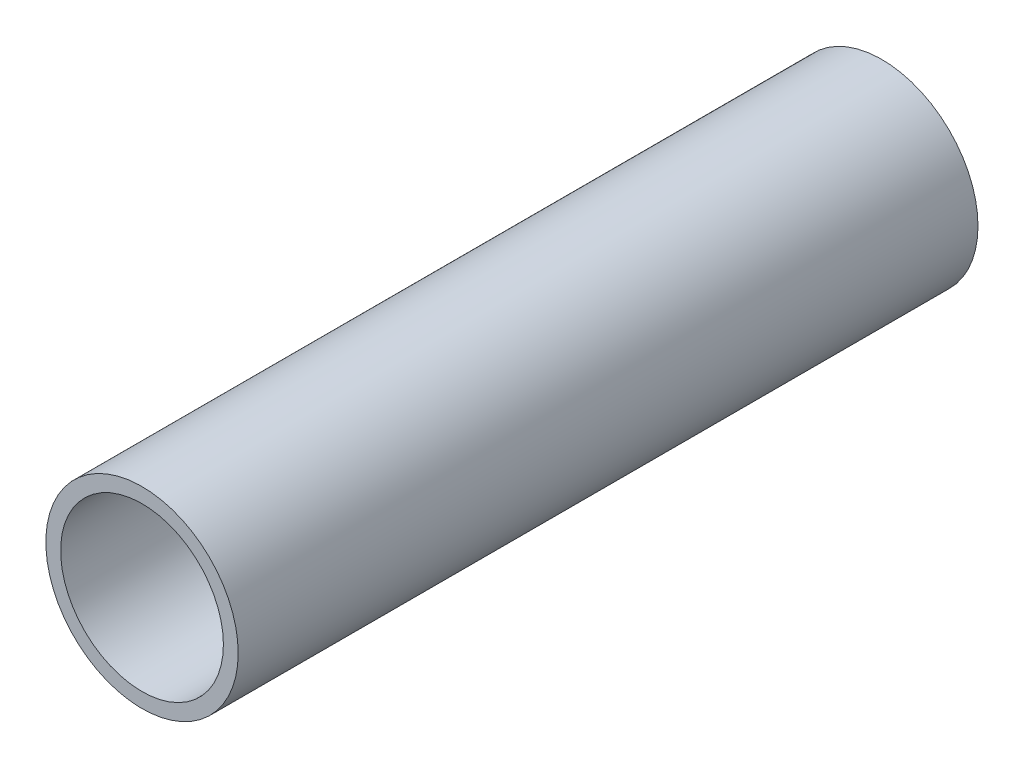
ISO-10303-21;
HEADER;
FILE_DESCRIPTION(('STEP AP214'),'2;1');
FILE_NAME('part.step','',(''),(''),'','','');
FILE_SCHEMA(('AUTOMOTIVE_DESIGN { 1 0 10303 214 1 1 1 1 }'));
ENDSEC;
DATA;
#1=APPLICATION_CONTEXT('core data for automotive mechanical design processes');
#2=APPLICATION_PROTOCOL_DEFINITION('international standard','automotive_design',2000,#1);
#3=PRODUCT_CONTEXT('',#1,'mechanical');
#4=PRODUCT('Part','Part','',(#3));
#5=PRODUCT_RELATED_PRODUCT_CATEGORY('part','',(#4));
#6=PRODUCT_DEFINITION_FORMATION('','',#4);
#7=PRODUCT_DEFINITION_CONTEXT('part definition',#1,'design');
#8=PRODUCT_DEFINITION('design','',#6,#7);
#9=PRODUCT_DEFINITION_SHAPE('','',#8);
#10=(LENGTH_UNIT() NAMED_UNIT(*) SI_UNIT(.MILLI.,.METRE.));
#11=(NAMED_UNIT(*) PLANE_ANGLE_UNIT() SI_UNIT($,.RADIAN.));
#12=(NAMED_UNIT(*) SI_UNIT($,.STERADIAN.) SOLID_ANGLE_UNIT());
#13=UNCERTAINTY_MEASURE_WITH_UNIT(LENGTH_MEASURE(1.E-05),#10,'distance_accuracy_value','');
#14=(GEOMETRIC_REPRESENTATION_CONTEXT(3) GLOBAL_UNCERTAINTY_ASSIGNED_CONTEXT((#13)) GLOBAL_UNIT_ASSIGNED_CONTEXT((#10,
#11,#12)) REPRESENTATION_CONTEXT('',''));
#15=CARTESIAN_POINT('',(0.,0.,0.));
#16=DIRECTION('',(0.,0.,1.));
#17=DIRECTION('',(1.,0.,0.));
#18=AXIS2_PLACEMENT_3D('',#15,#16,#17);
#19=CARTESIAN_POINT('',(0.,0.,500.));
#20=DIRECTION('',(0.,0.,1.));
#21=DIRECTION('',(1.,0.,0.));
#22=AXIS2_PLACEMENT_3D('',#19,#20,#21);
#23=PLANE('',#22);
#24=CARTESIAN_POINT('',(0.,0.,500.));
#25=DIRECTION('',(0.,0.,1.));
#26=DIRECTION('',(1.,0.,0.));
#27=AXIS2_PLACEMENT_3D('',#24,#25,#26);
#28=CIRCLE('',#27,65.);
#29=CARTESIAN_POINT('',(65.,0.,500.));
#30=VERTEX_POINT('',#29);
#31=EDGE_CURVE('E10',#30,#30,#28,.T.);
#32=ORIENTED_EDGE('',*,*,#31,.T.);
#33=EDGE_LOOP('',(#32));
#34=FACE_BOUND('',#33,.T.);
#35=CARTESIAN_POINT('',(0.,0.,500.));
#36=DIRECTION('',(0.,0.,1.));
#37=DIRECTION('',(1.,0.,0.));
#38=AXIS2_PLACEMENT_3D('',#35,#36,#37);
#39=CIRCLE('',#38,55.);
#40=CARTESIAN_POINT('',(55.,0.,500.));
#41=VERTEX_POINT('',#40);
#42=EDGE_CURVE('E42',#41,#41,#39,.T.);
#43=ORIENTED_EDGE('',*,*,#42,.F.);
#44=EDGE_LOOP('',(#43));
#45=FACE_BOUND('',#44,.T.);
#46=ADVANCED_FACE('F31',(#34,#45),#23,.T.);
#47=CARTESIAN_POINT('',(0.,0.,0.));
#48=DIRECTION('',(0.,0.,1.));
#49=DIRECTION('',(1.,0.,0.));
#50=AXIS2_PLACEMENT_3D('',#47,#48,#49);
#51=PLANE('',#50);
#52=CARTESIAN_POINT('',(0.,0.,0.));
#53=DIRECTION('',(0.,0.,1.));
#54=DIRECTION('',(1.,0.,0.));
#55=AXIS2_PLACEMENT_3D('',#52,#53,#54);
#56=CIRCLE('',#55,65.);
#57=CARTESIAN_POINT('',(65.,0.,0.));
#58=VERTEX_POINT('',#57);
#59=EDGE_CURVE('E35',#58,#58,#56,.T.);
#60=ORIENTED_EDGE('',*,*,#59,.F.);
#61=EDGE_LOOP('',(#60));
#62=FACE_BOUND('',#61,.T.);
#63=CARTESIAN_POINT('',(0.,0.,0.));
#64=DIRECTION('',(0.,0.,1.));
#65=DIRECTION('',(1.,0.,0.));
#66=AXIS2_PLACEMENT_3D('',#63,#64,#65);
#67=CIRCLE('',#66,55.);
#68=CARTESIAN_POINT('',(55.,0.,0.));
#69=VERTEX_POINT('',#68);
#70=EDGE_CURVE('E44',#69,#69,#67,.T.);
#71=ORIENTED_EDGE('',*,*,#70,.T.);
#72=EDGE_LOOP('',(#71));
#73=FACE_BOUND('',#72,.T.);
#74=ADVANCED_FACE('F54',(#62,#73),#51,.F.);
#75=CARTESIAN_POINT('',(0.,0.,500.));
#76=DIRECTION('',(0.,0.,-1.));
#77=DIRECTION('',(-1.,0.,0.));
#78=AXIS2_PLACEMENT_3D('',#75,#76,#77);
#79=CYLINDRICAL_SURFACE('',#78,65.);
#80=ORIENTED_EDGE('',*,*,#31,.F.);
#81=EDGE_LOOP('',(#80));
#82=FACE_BOUND('',#81,.T.);
#83=ORIENTED_EDGE('',*,*,#59,.T.);
#84=EDGE_LOOP('',(#83));
#85=FACE_BOUND('',#84,.T.);
#86=ADVANCED_FACE('F33',(#82,#85),#79,.T.);
#87=CARTESIAN_POINT('',(0.,0.,500.));
#88=DIRECTION('',(0.,0.,-1.));
#89=DIRECTION('',(-1.,0.,0.));
#90=AXIS2_PLACEMENT_3D('',#87,#88,#89);
#91=CYLINDRICAL_SURFACE('',#90,55.);
#92=ORIENTED_EDGE('',*,*,#42,.T.);
#93=EDGE_LOOP('',(#92));
#94=FACE_BOUND('',#93,.T.);
#95=ORIENTED_EDGE('',*,*,#70,.F.);
#96=EDGE_LOOP('',(#95));
#97=FACE_BOUND('',#96,.T.);
#98=ADVANCED_FACE('F50',(#94,#97),#91,.F.);
#99=CLOSED_SHELL('',(#46,#74,#86,#98));
#100=MANIFOLD_SOLID_BREP('B2',#99);
#101=ADVANCED_BREP_SHAPE_REPRESENTATION('',(#18,#100),#14);
#102=SHAPE_DEFINITION_REPRESENTATION(#9,#101);
ENDSEC;
END-ISO-10303-21;
